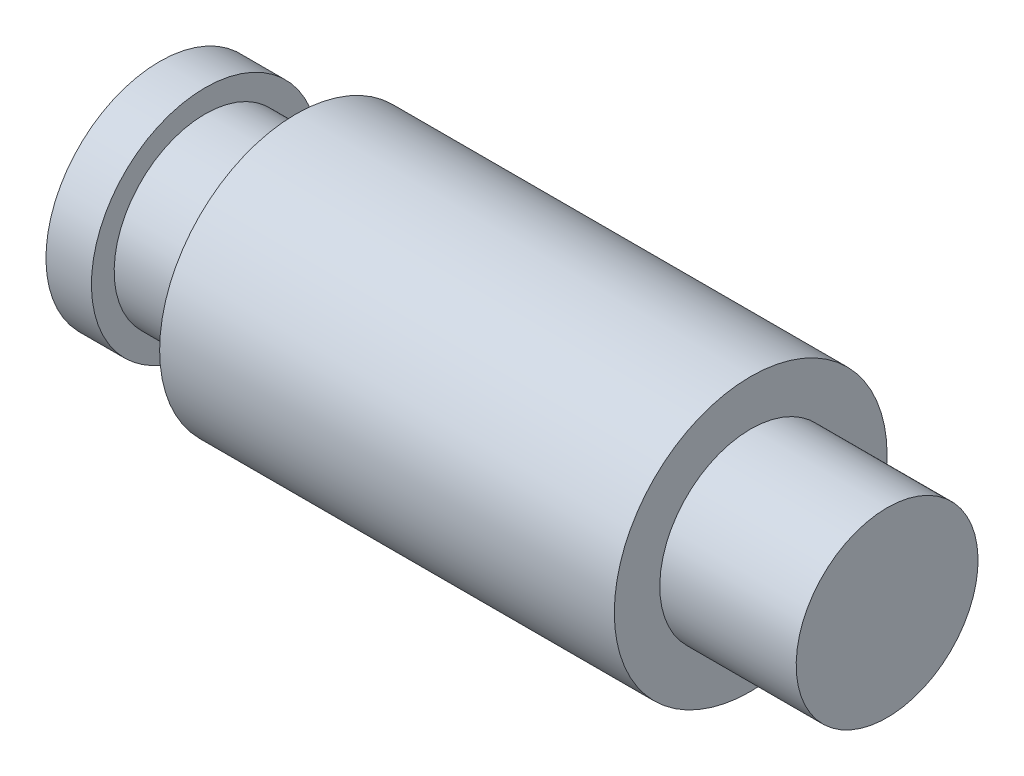
ISO-10303-21;
HEADER;
FILE_DESCRIPTION(('STEP AP214'),'2;1');
FILE_NAME('part.step','',(''),(''),'','','');
FILE_SCHEMA(('AUTOMOTIVE_DESIGN { 1 0 10303 214 1 1 1 1 }'));
ENDSEC;
DATA;
#1=APPLICATION_CONTEXT('core data for automotive mechanical design processes');
#2=APPLICATION_PROTOCOL_DEFINITION('international standard','automotive_design',2000,#1);
#3=PRODUCT_CONTEXT('',#1,'mechanical');
#4=PRODUCT('Part','Part','',(#3));
#5=PRODUCT_RELATED_PRODUCT_CATEGORY('part','',(#4));
#6=PRODUCT_DEFINITION_FORMATION('','',#4);
#7=PRODUCT_DEFINITION_CONTEXT('part definition',#1,'design');
#8=PRODUCT_DEFINITION('design','',#6,#7);
#9=PRODUCT_DEFINITION_SHAPE('','',#8);
#10=(LENGTH_UNIT() NAMED_UNIT(*) SI_UNIT(.MILLI.,.METRE.));
#11=(NAMED_UNIT(*) PLANE_ANGLE_UNIT() SI_UNIT($,.RADIAN.));
#12=(NAMED_UNIT(*) SI_UNIT($,.STERADIAN.) SOLID_ANGLE_UNIT());
#13=UNCERTAINTY_MEASURE_WITH_UNIT(LENGTH_MEASURE(1.E-05),#10,'distance_accuracy_value','');
#14=(GEOMETRIC_REPRESENTATION_CONTEXT(3) GLOBAL_UNCERTAINTY_ASSIGNED_CONTEXT((#13)) GLOBAL_UNIT_ASSIGNED_CONTEXT((#10,
#11,#12)) REPRESENTATION_CONTEXT('',''));
#15=CARTESIAN_POINT('',(0.,0.,0.));
#16=DIRECTION('',(0.,0.,1.));
#17=DIRECTION('',(1.,0.,0.));
#18=AXIS2_PLACEMENT_3D('',#15,#16,#17);
#19=CARTESIAN_POINT('',(0.,0.,0.));
#20=DIRECTION('',(-1.,0.,0.));
#21=DIRECTION('',(0.,-1.,0.));
#22=AXIS2_PLACEMENT_3D('',#19,#20,#21);
#23=PLANE('',#22);
#24=CARTESIAN_POINT('',(0.,0.,0.));
#25=DIRECTION('',(1.,0.,0.));
#26=DIRECTION('',(0.,1.,0.));
#27=AXIS2_PLACEMENT_3D('',#24,#25,#26);
#28=CIRCLE('',#27,2.5);
#29=CARTESIAN_POINT('',(0.,2.5,0.));
#30=VERTEX_POINT('',#29);
#31=EDGE_CURVE('E10',#30,#30,#28,.T.);
#32=ORIENTED_EDGE('',*,*,#31,.F.);
#33=EDGE_LOOP('',(#32));
#34=FACE_BOUND('',#33,.T.);
#35=ADVANCED_FACE('F36',(#34),#23,.T.);
#36=CARTESIAN_POINT('',(16.,0.,0.));
#37=DIRECTION('',(1.,0.,0.));
#38=DIRECTION('',(0.,1.,0.));
#39=AXIS2_PLACEMENT_3D('',#36,#37,#38);
#40=CYLINDRICAL_SURFACE('',#39,2.5);
#41=ORIENTED_EDGE('',*,*,#31,.T.);
#42=EDGE_LOOP('',(#41));
#43=FACE_BOUND('',#42,.T.);
#44=CARTESIAN_POINT('',(1.,0.,0.));
#45=DIRECTION('',(1.,0.,0.));
#46=DIRECTION('',(0.,1.,0.));
#47=AXIS2_PLACEMENT_3D('',#44,#45,#46);
#48=CIRCLE('',#47,2.5);
#49=CARTESIAN_POINT('',(1.,2.5,0.));
#50=VERTEX_POINT('',#49);
#51=EDGE_CURVE('E42',#50,#50,#48,.T.);
#52=ORIENTED_EDGE('',*,*,#51,.F.);
#53=EDGE_LOOP('',(#52));
#54=FACE_BOUND('',#53,.T.);
#55=ADVANCED_FACE('F84',(#43,#54),#40,.T.);
#56=CARTESIAN_POINT('',(1.,2.5,0.));
#57=DIRECTION('',(1.,0.,0.));
#58=DIRECTION('',(0.,1.,0.));
#59=AXIS2_PLACEMENT_3D('',#56,#57,#58);
#60=PLANE('',#59);
#61=ORIENTED_EDGE('',*,*,#51,.T.);
#62=EDGE_LOOP('',(#61));
#63=FACE_BOUND('',#62,.T.);
#64=CARTESIAN_POINT('',(1.,0.,0.));
#65=DIRECTION('',(1.,0.,0.));
#66=DIRECTION('',(0.,1.,0.));
#67=AXIS2_PLACEMENT_3D('',#64,#65,#66);
#68=CIRCLE('',#67,2.);
#69=CARTESIAN_POINT('',(1.,2.,0.));
#70=VERTEX_POINT('',#69);
#71=EDGE_CURVE('E46',#70,#70,#68,.T.);
#72=ORIENTED_EDGE('',*,*,#71,.F.);
#73=EDGE_LOOP('',(#72));
#74=FACE_BOUND('',#73,.T.);
#75=ADVANCED_FACE('F88',(#63,#74),#60,.T.);
#76=CARTESIAN_POINT('',(16.,0.,0.));
#77=DIRECTION('',(1.,0.,0.));
#78=DIRECTION('',(0.,1.,0.));
#79=AXIS2_PLACEMENT_3D('',#76,#77,#78);
#80=CYLINDRICAL_SURFACE('',#79,2.);
#81=ORIENTED_EDGE('',*,*,#71,.T.);
#82=EDGE_LOOP('',(#81));
#83=FACE_BOUND('',#82,.T.);
#84=CARTESIAN_POINT('',(3.,0.,0.));
#85=DIRECTION('',(1.,0.,0.));
#86=DIRECTION('',(0.,1.,0.));
#87=AXIS2_PLACEMENT_3D('',#84,#85,#86);
#88=CIRCLE('',#87,2.);
#89=CARTESIAN_POINT('',(3.,2.,0.));
#90=VERTEX_POINT('',#89);
#91=EDGE_CURVE('E50',#90,#90,#88,.T.);
#92=ORIENTED_EDGE('',*,*,#91,.F.);
#93=EDGE_LOOP('',(#92));
#94=FACE_BOUND('',#93,.T.);
#95=ADVANCED_FACE('F92',(#83,#94),#80,.T.);
#96=CARTESIAN_POINT('',(3.,2.,0.));
#97=DIRECTION('',(-1.,0.,0.));
#98=DIRECTION('',(0.,-1.,0.));
#99=AXIS2_PLACEMENT_3D('',#96,#97,#98);
#100=PLANE('',#99);
#101=ORIENTED_EDGE('',*,*,#91,.T.);
#102=EDGE_LOOP('',(#101));
#103=FACE_BOUND('',#102,.T.);
#104=CARTESIAN_POINT('',(3.,0.,0.));
#105=DIRECTION('',(1.,0.,0.));
#106=DIRECTION('',(0.,1.,0.));
#107=AXIS2_PLACEMENT_3D('',#104,#105,#106);
#108=CIRCLE('',#107,3.);
#109=CARTESIAN_POINT('',(3.,3.,0.));
#110=VERTEX_POINT('',#109);
#111=EDGE_CURVE('E55',#110,#110,#108,.T.);
#112=ORIENTED_EDGE('',*,*,#111,.F.);
#113=EDGE_LOOP('',(#112));
#114=FACE_BOUND('',#113,.T.);
#115=ADVANCED_FACE('F98',(#103,#114),#100,.T.);
#116=CARTESIAN_POINT('',(16.,0.,0.));
#117=DIRECTION('',(1.,0.,0.));
#118=DIRECTION('',(0.,1.,0.));
#119=AXIS2_PLACEMENT_3D('',#116,#117,#118);
#120=CYLINDRICAL_SURFACE('',#119,3.);
#121=ORIENTED_EDGE('',*,*,#111,.T.);
#122=EDGE_LOOP('',(#121));
#123=FACE_BOUND('',#122,.T.);
#124=CARTESIAN_POINT('',(13.,0.,0.));
#125=DIRECTION('',(1.,0.,0.));
#126=DIRECTION('',(0.,1.,0.));
#127=AXIS2_PLACEMENT_3D('',#124,#125,#126);
#128=CIRCLE('',#127,3.);
#129=CARTESIAN_POINT('',(13.,3.,0.));
#130=VERTEX_POINT('',#129);
#131=EDGE_CURVE('E58',#130,#130,#128,.T.);
#132=ORIENTED_EDGE('',*,*,#131,.F.);
#133=EDGE_LOOP('',(#132));
#134=FACE_BOUND('',#133,.T.);
#135=ADVANCED_FACE('F80',(#123,#134),#120,.T.);
#136=CARTESIAN_POINT('',(13.,3.,0.));
#137=DIRECTION('',(1.,0.,0.));
#138=DIRECTION('',(0.,1.,0.));
#139=AXIS2_PLACEMENT_3D('',#136,#137,#138);
#140=PLANE('',#139);
#141=ORIENTED_EDGE('',*,*,#131,.T.);
#142=EDGE_LOOP('',(#141));
#143=FACE_BOUND('',#142,.T.);
#144=CARTESIAN_POINT('',(13.,0.,0.));
#145=DIRECTION('',(1.,0.,0.));
#146=DIRECTION('',(0.,1.,0.));
#147=AXIS2_PLACEMENT_3D('',#144,#145,#146);
#148=CIRCLE('',#147,2.);
#149=CARTESIAN_POINT('',(13.,2.,0.));
#150=VERTEX_POINT('',#149);
#151=EDGE_CURVE('E61',#150,#150,#148,.T.);
#152=ORIENTED_EDGE('',*,*,#151,.F.);
#153=EDGE_LOOP('',(#152));
#154=FACE_BOUND('',#153,.T.);
#155=ADVANCED_FACE('F72',(#143,#154),#140,.T.);
#156=CARTESIAN_POINT('',(16.,0.,0.));
#157=DIRECTION('',(1.,0.,0.));
#158=DIRECTION('',(0.,1.,0.));
#159=AXIS2_PLACEMENT_3D('',#156,#157,#158);
#160=CYLINDRICAL_SURFACE('',#159,2.);
#161=ORIENTED_EDGE('',*,*,#151,.T.);
#162=EDGE_LOOP('',(#161));
#163=FACE_BOUND('',#162,.T.);
#164=CARTESIAN_POINT('',(16.,0.,0.));
#165=DIRECTION('',(1.,0.,0.));
#166=DIRECTION('',(0.,1.,0.));
#167=AXIS2_PLACEMENT_3D('',#164,#165,#166);
#168=CIRCLE('',#167,2.);
#169=CARTESIAN_POINT('',(16.,2.,0.));
#170=VERTEX_POINT('',#169);
#171=EDGE_CURVE('E64',#170,#170,#168,.T.);
#172=ORIENTED_EDGE('',*,*,#171,.F.);
#173=EDGE_LOOP('',(#172));
#174=FACE_BOUND('',#173,.T.);
#175=ADVANCED_FACE('F70',(#163,#174),#160,.T.);
#176=CARTESIAN_POINT('',(16.,2.,0.));
#177=DIRECTION('',(1.,0.,0.));
#178=DIRECTION('',(0.,1.,0.));
#179=AXIS2_PLACEMENT_3D('',#176,#177,#178);
#180=PLANE('',#179);
#181=ORIENTED_EDGE('',*,*,#171,.T.);
#182=EDGE_LOOP('',(#181));
#183=FACE_BOUND('',#182,.T.);
#184=ADVANCED_FACE('F68',(#183),#180,.T.);
#185=CLOSED_SHELL('',(#35,#55,#75,#95,#115,#135,#155,#175,#184));
#186=MANIFOLD_SOLID_BREP('B2',#185);
#187=ADVANCED_BREP_SHAPE_REPRESENTATION('',(#18,#186),#14);
#188=SHAPE_DEFINITION_REPRESENTATION(#9,#187);
ENDSEC;
END-ISO-10303-21;
